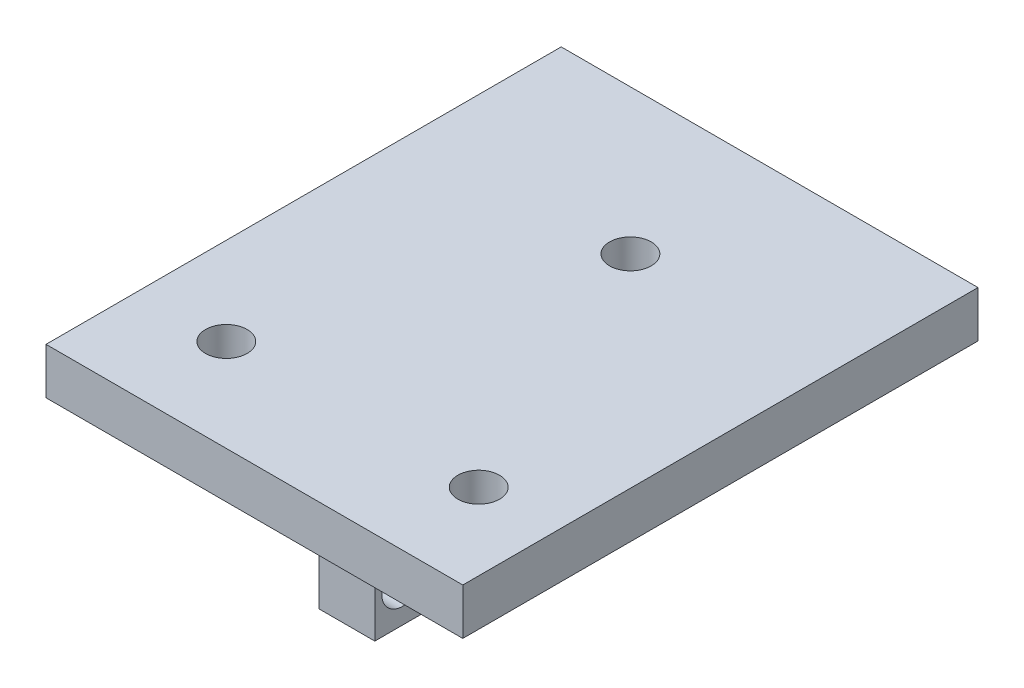
ISO-10303-21;
HEADER;
FILE_DESCRIPTION(('STEP AP214'),'2;1');
FILE_NAME('part.step','',(''),(''),'','','');
FILE_SCHEMA(('AUTOMOTIVE_DESIGN { 1 0 10303 214 1 1 1 1 }'));
ENDSEC;
DATA;
#1=APPLICATION_CONTEXT('core data for automotive mechanical design processes');
#2=APPLICATION_PROTOCOL_DEFINITION('international standard','automotive_design',2000,#1);
#3=PRODUCT_CONTEXT('',#1,'mechanical');
#4=PRODUCT('Part','Part','',(#3));
#5=PRODUCT_RELATED_PRODUCT_CATEGORY('part','',(#4));
#6=PRODUCT_DEFINITION_FORMATION('','',#4);
#7=PRODUCT_DEFINITION_CONTEXT('part definition',#1,'design');
#8=PRODUCT_DEFINITION('design','',#6,#7);
#9=PRODUCT_DEFINITION_SHAPE('','',#8);
#10=(LENGTH_UNIT() NAMED_UNIT(*) SI_UNIT(.MILLI.,.METRE.));
#11=(NAMED_UNIT(*) PLANE_ANGLE_UNIT() SI_UNIT($,.RADIAN.));
#12=(NAMED_UNIT(*) SI_UNIT($,.STERADIAN.) SOLID_ANGLE_UNIT());
#13=UNCERTAINTY_MEASURE_WITH_UNIT(LENGTH_MEASURE(1.E-05),#10,'distance_accuracy_value','');
#14=(GEOMETRIC_REPRESENTATION_CONTEXT(3) GLOBAL_UNCERTAINTY_ASSIGNED_CONTEXT((#13)) GLOBAL_UNIT_ASSIGNED_CONTEXT((#10,
#11,#12)) REPRESENTATION_CONTEXT('',''));
#15=CARTESIAN_POINT('',(0.,0.,0.));
#16=DIRECTION('',(0.,0.,1.));
#17=DIRECTION('',(1.,0.,0.));
#18=AXIS2_PLACEMENT_3D('',#15,#16,#17);
#19=CARTESIAN_POINT('',(0.,0.,0.));
#20=DIRECTION('',(0.,1.,0.));
#21=DIRECTION('',(0.,0.,1.));
#22=AXIS2_PLACEMENT_3D('',#19,#20,#21);
#23=PLANE('',#22);
#24=DIRECTION('',(0.,0.,-1.));
#25=VECTOR('',#24,1.);
#26=CARTESIAN_POINT('',(5.16102338934393,0.,-50.5));
#27=LINE('',#26,#25);
#28=CARTESIAN_POINT('',(5.16102338934393,0.,-44.5));
#29=VERTEX_POINT('',#28);
#30=CARTESIAN_POINT('',(5.16102338934393,0.,-50.5));
#31=VERTEX_POINT('',#30);
#32=EDGE_CURVE('E145',#29,#31,#27,.T.);
#33=ORIENTED_EDGE('',*,*,#32,.F.);
#34=DIRECTION('',(-1.,0.,0.));
#35=VECTOR('',#34,1.);
#36=CARTESIAN_POINT('',(5.16102338934393,0.,-44.5));
#37=LINE('',#36,#35);
#38=CARTESIAN_POINT('',(11.1610233893439,0.,-44.5));
#39=VERTEX_POINT('',#38);
#40=EDGE_CURVE('E158',#39,#29,#37,.T.);
#41=ORIENTED_EDGE('',*,*,#40,.F.);
#42=DIRECTION('',(0.,0.,1.));
#43=VECTOR('',#42,1.);
#44=CARTESIAN_POINT('',(11.1610233893439,0.,-50.5));
#45=LINE('',#44,#43);
#46=CARTESIAN_POINT('',(11.1610233893439,0.,-50.5));
#47=VERTEX_POINT('',#46);
#48=EDGE_CURVE('E167',#47,#39,#45,.T.);
#49=ORIENTED_EDGE('',*,*,#48,.F.);
#50=DIRECTION('',(1.,0.,0.));
#51=VECTOR('',#50,1.);
#52=CARTESIAN_POINT('',(5.16102338934393,0.,-50.5));
#53=LINE('',#52,#51);
#54=EDGE_CURVE('E148',#31,#47,#53,.T.);
#55=ORIENTED_EDGE('',*,*,#54,.F.);
#56=EDGE_LOOP('',(#33,#41,#49,#55));
#57=FACE_BOUND('',#56,.T.);
#58=CARTESIAN_POINT('',(-4.87219612087947,0.,-10.));
#59=DIRECTION('',(0.,-1.,0.));
#60=DIRECTION('',(0.,0.,-1.));
#61=AXIS2_PLACEMENT_3D('',#58,#59,#60);
#62=CIRCLE('',#61,2.24789999999999);
#63=CARTESIAN_POINT('',(-4.87219612087947,0.,-12.2479));
#64=VERTEX_POINT('',#63);
#65=EDGE_CURVE('E187',#64,#64,#62,.T.);
#66=ORIENTED_EDGE('',*,*,#65,.F.);
#67=EDGE_LOOP('',(#66));
#68=FACE_BOUND('',#67,.T.);
#69=DIRECTION('',(0.,0.,1.));
#70=VECTOR('',#69,1.);
#71=CARTESIAN_POINT('',(-14.3389766106561,0.,-55.6214886532175));
#72=LINE('',#71,#70);
#73=CARTESIAN_POINT('',(-14.3389766106561,0.,-55.6214886532175));
#74=VERTEX_POINT('',#73);
#75=CARTESIAN_POINT('',(-14.3389766106561,0.,0.));
#76=VERTEX_POINT('',#75);
#77=EDGE_CURVE('E199',#74,#76,#72,.T.);
#78=ORIENTED_EDGE('',*,*,#77,.F.);
#79=DIRECTION('',(-1.,0.,0.));
#80=VECTOR('',#79,1.);
#81=CARTESIAN_POINT('',(8.16102338934392,0.,-55.6214886532175));
#82=LINE('',#81,#80);
#83=CARTESIAN_POINT('',(30.6610233893439,0.,-55.6214886532175));
#84=VERTEX_POINT('',#83);
#85=EDGE_CURVE('E204',#84,#74,#82,.T.);
#86=ORIENTED_EDGE('',*,*,#85,.F.);
#87=DIRECTION('',(0.,0.,-1.));
#88=VECTOR('',#87,1.);
#89=CARTESIAN_POINT('',(30.6610233893439,0.,-55.6214886532175));
#90=LINE('',#89,#88);
#91=CARTESIAN_POINT('',(30.6610233893439,0.,0.));
#92=VERTEX_POINT('',#91);
#93=EDGE_CURVE('E215',#92,#84,#90,.T.);
#94=ORIENTED_EDGE('',*,*,#93,.F.);
#95=DIRECTION('',(1.,0.,0.));
#96=VECTOR('',#95,1.);
#97=CARTESIAN_POINT('',(-14.3389766106561,0.,0.));
#98=LINE('',#97,#96);
#99=EDGE_CURVE('E213',#76,#92,#98,.T.);
#100=ORIENTED_EDGE('',*,*,#99,.F.);
#101=EDGE_LOOP('',(#78,#86,#94,#100));
#102=FACE_BOUND('',#101,.T.);
#103=CARTESIAN_POINT('',(8.75280387912053,0.,-40.001031232276));
#104=DIRECTION('',(0.,-1.,0.));
#105=DIRECTION('',(0.,0.,-1.));
#106=AXIS2_PLACEMENT_3D('',#103,#104,#105);
#107=CIRCLE('',#106,2.24789999999999);
#108=CARTESIAN_POINT('',(8.75280387912053,0.,-42.248931232276));
#109=VERTEX_POINT('',#108);
#110=EDGE_CURVE('E193',#109,#109,#107,.T.);
#111=ORIENTED_EDGE('',*,*,#110,.F.);
#112=EDGE_LOOP('',(#111));
#113=FACE_BOUND('',#112,.T.);
#114=CARTESIAN_POINT('',(22.3778038791205,0.,-10.));
#115=DIRECTION('',(0.,-1.,0.));
#116=DIRECTION('',(0.,0.,-1.));
#117=AXIS2_PLACEMENT_3D('',#114,#115,#116);
#118=CIRCLE('',#117,2.24789999999999);
#119=CARTESIAN_POINT('',(22.3778038791205,0.,-12.2479));
#120=VERTEX_POINT('',#119);
#121=EDGE_CURVE('E183',#120,#120,#118,.T.);
#122=ORIENTED_EDGE('',*,*,#121,.F.);
#123=EDGE_LOOP('',(#122));
#124=FACE_BOUND('',#123,.T.);
#125=DIRECTION('',(0.,0.,-1.));
#126=VECTOR('',#125,1.);
#127=CARTESIAN_POINT('',(5.16102338934393,0.,-16.));
#128=LINE('',#127,#126);
#129=CARTESIAN_POINT('',(5.16102338934392,0.,-10.));
#130=VERTEX_POINT('',#129);
#131=CARTESIAN_POINT('',(5.16102338934393,0.,-16.));
#132=VERTEX_POINT('',#131);
#133=EDGE_CURVE('E144',#130,#132,#128,.T.);
#134=ORIENTED_EDGE('',*,*,#133,.F.);
#135=DIRECTION('',(-1.,0.,0.));
#136=VECTOR('',#135,1.);
#137=CARTESIAN_POINT('',(5.16102338934392,0.,-10.));
#138=LINE('',#137,#136);
#139=CARTESIAN_POINT('',(11.1610233893439,0.,-10.));
#140=VERTEX_POINT('',#139);
#141=EDGE_CURVE('E141',#140,#130,#138,.T.);
#142=ORIENTED_EDGE('',*,*,#141,.F.);
#143=DIRECTION('',(0.,0.,1.));
#144=VECTOR('',#143,1.);
#145=CARTESIAN_POINT('',(11.1610233893439,0.,-16.));
#146=LINE('',#145,#144);
#147=CARTESIAN_POINT('',(11.1610233893439,0.,-16.));
#148=VERTEX_POINT('',#147);
#149=EDGE_CURVE('E55',#148,#140,#146,.T.);
#150=ORIENTED_EDGE('',*,*,#149,.F.);
#151=DIRECTION('',(1.,0.,0.));
#152=VECTOR('',#151,1.);
#153=CARTESIAN_POINT('',(5.16102338934393,0.,-16.));
#154=LINE('',#153,#152);
#155=EDGE_CURVE('E50',#132,#148,#154,.T.);
#156=ORIENTED_EDGE('',*,*,#155,.F.);
#157=EDGE_LOOP('',(#134,#142,#150,#156));
#158=FACE_BOUND('',#157,.T.);
#159=ADVANCED_FACE('F33',(#57,#68,#102,#113,#124,#158),#23,.F.);
#160=CARTESIAN_POINT('',(-14.3389766106561,5.,-55.6214886532175));
#161=DIRECTION('',(1.,0.,0.));
#162=DIRECTION('',(0.,0.,-1.));
#163=AXIS2_PLACEMENT_3D('',#160,#161,#162);
#164=PLANE('',#163);
#165=ORIENTED_EDGE('',*,*,#77,.T.);
#166=DIRECTION('',(0.,-1.,0.));
#167=VECTOR('',#166,1.);
#168=CARTESIAN_POINT('',(-14.3389766106561,5.,0.));
#169=LINE('',#168,#167);
#170=CARTESIAN_POINT('',(-14.3389766106561,5.,0.));
#171=VERTEX_POINT('',#170);
#172=EDGE_CURVE('E11',#171,#76,#169,.T.);
#173=ORIENTED_EDGE('',*,*,#172,.F.);
#174=DIRECTION('',(0.,0.,1.));
#175=VECTOR('',#174,1.);
#176=CARTESIAN_POINT('',(-14.3389766106561,5.,-55.6214886532175));
#177=LINE('',#176,#175);
#178=CARTESIAN_POINT('',(-14.3389766106561,5.,-55.6214886532175));
#179=VERTEX_POINT('',#178);
#180=EDGE_CURVE('E200',#179,#171,#177,.T.);
#181=ORIENTED_EDGE('',*,*,#180,.F.);
#182=DIRECTION('',(0.,-1.,0.));
#183=VECTOR('',#182,1.);
#184=CARTESIAN_POINT('',(-14.3389766106561,5.,-55.6214886532175));
#185=LINE('',#184,#183);
#186=EDGE_CURVE('E210',#179,#74,#185,.T.);
#187=ORIENTED_EDGE('',*,*,#186,.T.);
#188=EDGE_LOOP('',(#165,#173,#181,#187));
#189=FACE_BOUND('',#188,.T.);
#190=ADVANCED_FACE('F35',(#189),#164,.F.);
#191=CARTESIAN_POINT('',(-14.3389766106561,5.,0.));
#192=DIRECTION('',(0.,0.,-1.));
#193=DIRECTION('',(-1.,0.,0.));
#194=AXIS2_PLACEMENT_3D('',#191,#192,#193);
#195=PLANE('',#194);
#196=ORIENTED_EDGE('',*,*,#99,.T.);
#197=DIRECTION('',(0.,-1.,0.));
#198=VECTOR('',#197,1.);
#199=CARTESIAN_POINT('',(30.6610233893439,5.,0.));
#200=LINE('',#199,#198);
#201=CARTESIAN_POINT('',(30.6610233893439,5.,0.));
#202=VERTEX_POINT('',#201);
#203=EDGE_CURVE('E42',#202,#92,#200,.T.);
#204=ORIENTED_EDGE('',*,*,#203,.F.);
#205=DIRECTION('',(1.,0.,0.));
#206=VECTOR('',#205,1.);
#207=CARTESIAN_POINT('',(-14.3389766106561,5.,0.));
#208=LINE('',#207,#206);
#209=EDGE_CURVE('E203',#171,#202,#208,.T.);
#210=ORIENTED_EDGE('',*,*,#209,.F.);
#211=ORIENTED_EDGE('',*,*,#172,.T.);
#212=EDGE_LOOP('',(#196,#204,#210,#211));
#213=FACE_BOUND('',#212,.T.);
#214=ADVANCED_FACE('F249',(#213),#195,.F.);
#215=CARTESIAN_POINT('',(30.6610233893439,5.,-55.6214886532175));
#216=DIRECTION('',(-1.,0.,0.));
#217=DIRECTION('',(0.,0.,1.));
#218=AXIS2_PLACEMENT_3D('',#215,#216,#217);
#219=PLANE('',#218);
#220=ORIENTED_EDGE('',*,*,#93,.T.);
#221=DIRECTION('',(0.,-1.,0.));
#222=VECTOR('',#221,1.);
#223=CARTESIAN_POINT('',(30.6610233893439,5.,-55.6214886532175));
#224=LINE('',#223,#222);
#225=CARTESIAN_POINT('',(30.6610233893439,5.,-55.6214886532175));
#226=VERTEX_POINT('',#225);
#227=EDGE_CURVE('E221',#226,#84,#224,.T.);
#228=ORIENTED_EDGE('',*,*,#227,.F.);
#229=DIRECTION('',(0.,0.,-1.));
#230=VECTOR('',#229,1.);
#231=CARTESIAN_POINT('',(30.6610233893439,5.,-55.6214886532175));
#232=LINE('',#231,#230);
#233=EDGE_CURVE('E206',#202,#226,#232,.T.);
#234=ORIENTED_EDGE('',*,*,#233,.F.);
#235=ORIENTED_EDGE('',*,*,#203,.T.);
#236=EDGE_LOOP('',(#220,#228,#234,#235));
#237=FACE_BOUND('',#236,.T.);
#238=ADVANCED_FACE('F254',(#237),#219,.F.);
#239=CARTESIAN_POINT('',(8.16102338934392,5.,-55.6214886532175));
#240=DIRECTION('',(0.,0.,1.));
#241=DIRECTION('',(1.,0.,0.));
#242=AXIS2_PLACEMENT_3D('',#239,#240,#241);
#243=PLANE('',#242);
#244=ORIENTED_EDGE('',*,*,#85,.T.);
#245=ORIENTED_EDGE('',*,*,#186,.F.);
#246=DIRECTION('',(-1.,0.,0.));
#247=VECTOR('',#246,1.);
#248=CARTESIAN_POINT('',(8.16102338934392,5.,-55.6214886532175));
#249=LINE('',#248,#247);
#250=EDGE_CURVE('E208',#226,#179,#249,.T.);
#251=ORIENTED_EDGE('',*,*,#250,.F.);
#252=ORIENTED_EDGE('',*,*,#227,.T.);
#253=EDGE_LOOP('',(#244,#245,#251,#252));
#254=FACE_BOUND('',#253,.T.);
#255=ADVANCED_FACE('F235',(#254),#243,.F.);
#256=CARTESIAN_POINT('',(0.,5.,0.));
#257=DIRECTION('',(0.,1.,0.));
#258=DIRECTION('',(0.,0.,1.));
#259=AXIS2_PLACEMENT_3D('',#256,#257,#258);
#260=PLANE('',#259);
#261=CARTESIAN_POINT('',(22.3778038791205,5.,-10.));
#262=DIRECTION('',(0.,1.,0.));
#263=DIRECTION('',(0.,0.,1.));
#264=AXIS2_PLACEMENT_3D('',#261,#262,#263);
#265=CIRCLE('',#264,2.24789999999999);
#266=CARTESIAN_POINT('',(22.3778038791205,5.,-7.75210000000001));
#267=VERTEX_POINT('',#266);
#268=EDGE_CURVE('E186',#267,#267,#265,.T.);
#269=ORIENTED_EDGE('',*,*,#268,.F.);
#270=EDGE_LOOP('',(#269));
#271=FACE_BOUND('',#270,.T.);
#272=CARTESIAN_POINT('',(-4.87219612087947,5.,-10.));
#273=DIRECTION('',(0.,1.,0.));
#274=DIRECTION('',(0.,0.,1.));
#275=AXIS2_PLACEMENT_3D('',#272,#273,#274);
#276=CIRCLE('',#275,2.24789999999999);
#277=CARTESIAN_POINT('',(-4.87219612087947,5.,-7.75210000000001));
#278=VERTEX_POINT('',#277);
#279=EDGE_CURVE('E190',#278,#278,#276,.T.);
#280=ORIENTED_EDGE('',*,*,#279,.F.);
#281=EDGE_LOOP('',(#280));
#282=FACE_BOUND('',#281,.T.);
#283=CARTESIAN_POINT('',(8.75280387912053,5.,-40.001031232276));
#284=DIRECTION('',(0.,1.,0.));
#285=DIRECTION('',(0.,0.,1.));
#286=AXIS2_PLACEMENT_3D('',#283,#284,#285);
#287=CIRCLE('',#286,2.24789999999999);
#288=CARTESIAN_POINT('',(8.75280387912053,5.,-37.753131232276));
#289=VERTEX_POINT('',#288);
#290=EDGE_CURVE('E196',#289,#289,#287,.T.);
#291=ORIENTED_EDGE('',*,*,#290,.F.);
#292=EDGE_LOOP('',(#291));
#293=FACE_BOUND('',#292,.T.);
#294=ORIENTED_EDGE('',*,*,#180,.T.);
#295=ORIENTED_EDGE('',*,*,#209,.T.);
#296=ORIENTED_EDGE('',*,*,#233,.T.);
#297=ORIENTED_EDGE('',*,*,#250,.T.);
#298=EDGE_LOOP('',(#294,#295,#296,#297));
#299=FACE_BOUND('',#298,.T.);
#300=ADVANCED_FACE('F231',(#271,#282,#293,#299),#260,.T.);
#301=CARTESIAN_POINT('',(8.75280387912053,0.,-40.001031232276));
#302=DIRECTION('',(0.,-1.,0.));
#303=DIRECTION('',(0.,0.,-1.));
#304=AXIS2_PLACEMENT_3D('',#301,#302,#303);
#305=CYLINDRICAL_SURFACE('',#304,2.24789999999999);
#306=ORIENTED_EDGE('',*,*,#290,.T.);
#307=EDGE_LOOP('',(#306));
#308=FACE_BOUND('',#307,.T.);
#309=ORIENTED_EDGE('',*,*,#110,.T.);
#310=EDGE_LOOP('',(#309));
#311=FACE_BOUND('',#310,.T.);
#312=ADVANCED_FACE('F234',(#308,#311),#305,.F.);
#313=CARTESIAN_POINT('',(-4.87219612087947,0.,-10.));
#314=DIRECTION('',(0.,-1.,0.));
#315=DIRECTION('',(0.,0.,-1.));
#316=AXIS2_PLACEMENT_3D('',#313,#314,#315);
#317=CYLINDRICAL_SURFACE('',#316,2.24789999999999);
#318=ORIENTED_EDGE('',*,*,#279,.T.);
#319=EDGE_LOOP('',(#318));
#320=FACE_BOUND('',#319,.T.);
#321=ORIENTED_EDGE('',*,*,#65,.T.);
#322=EDGE_LOOP('',(#321));
#323=FACE_BOUND('',#322,.T.);
#324=ADVANCED_FACE('F337',(#320,#323),#317,.F.);
#325=CARTESIAN_POINT('',(22.3778038791205,0.,-10.));
#326=DIRECTION('',(0.,-1.,0.));
#327=DIRECTION('',(0.,0.,-1.));
#328=AXIS2_PLACEMENT_3D('',#325,#326,#327);
#329=CYLINDRICAL_SURFACE('',#328,2.24789999999999);
#330=ORIENTED_EDGE('',*,*,#268,.T.);
#331=EDGE_LOOP('',(#330));
#332=FACE_BOUND('',#331,.T.);
#333=ORIENTED_EDGE('',*,*,#121,.T.);
#334=EDGE_LOOP('',(#333));
#335=FACE_BOUND('',#334,.T.);
#336=ADVANCED_FACE('F228',(#332,#335),#329,.F.);
#337=CARTESIAN_POINT('',(5.16102338934393,-15.,-50.5));
#338=DIRECTION('',(1.,0.,0.));
#339=DIRECTION('',(0.,0.,-1.));
#340=AXIS2_PLACEMENT_3D('',#337,#338,#339);
#341=PLANE('',#340);
#342=CARTESIAN_POINT('',(5.16102338934393,-11.,-47.5));
#343=DIRECTION('',(-1.,0.,0.));
#344=DIRECTION('',(0.,0.,1.));
#345=AXIS2_PLACEMENT_3D('',#342,#343,#344);
#346=CIRCLE('',#345,2.24789999999999);
#347=CARTESIAN_POINT('',(5.16102338934393,-11.,-45.2521));
#348=VERTEX_POINT('',#347);
#349=EDGE_CURVE('E284',#348,#348,#346,.T.);
#350=ORIENTED_EDGE('',*,*,#349,.F.);
#351=EDGE_LOOP('',(#350));
#352=FACE_BOUND('',#351,.T.);
#353=ORIENTED_EDGE('',*,*,#32,.T.);
#354=DIRECTION('',(0.,1.,0.));
#355=VECTOR('',#354,1.);
#356=CARTESIAN_POINT('',(5.16102338934393,-15.,-50.5));
#357=LINE('',#356,#355);
#358=CARTESIAN_POINT('',(5.16102338934393,-15.,-50.5));
#359=VERTEX_POINT('',#358);
#360=EDGE_CURVE('E180',#359,#31,#357,.T.);
#361=ORIENTED_EDGE('',*,*,#360,.F.);
#362=DIRECTION('',(0.,0.,-1.));
#363=VECTOR('',#362,1.);
#364=CARTESIAN_POINT('',(5.16102338934393,-15.,-50.5));
#365=LINE('',#364,#363);
#366=CARTESIAN_POINT('',(5.16102338934393,-15.,-44.5));
#367=VERTEX_POINT('',#366);
#368=EDGE_CURVE('E154',#367,#359,#365,.T.);
#369=ORIENTED_EDGE('',*,*,#368,.F.);
#370=DIRECTION('',(0.,1.,0.));
#371=VECTOR('',#370,1.);
#372=CARTESIAN_POINT('',(5.16102338934393,-15.,-44.5));
#373=LINE('',#372,#371);
#374=EDGE_CURVE('E163',#367,#29,#373,.T.);
#375=ORIENTED_EDGE('',*,*,#374,.T.);
#376=EDGE_LOOP('',(#353,#361,#369,#375));
#377=FACE_BOUND('',#376,.T.);
#378=ADVANCED_FACE('F330',(#352,#377),#341,.F.);
#379=CARTESIAN_POINT('',(5.16102338934393,-15.,-50.5));
#380=DIRECTION('',(0.,0.,1.));
#381=DIRECTION('',(1.,0.,0.));
#382=AXIS2_PLACEMENT_3D('',#379,#380,#381);
#383=PLANE('',#382);
#384=ORIENTED_EDGE('',*,*,#54,.T.);
#385=DIRECTION('',(0.,1.,0.));
#386=VECTOR('',#385,1.);
#387=CARTESIAN_POINT('',(11.1610233893439,-15.,-50.5));
#388=LINE('',#387,#386);
#389=CARTESIAN_POINT('',(11.1610233893439,-15.,-50.5));
#390=VERTEX_POINT('',#389);
#391=EDGE_CURVE('E177',#390,#47,#388,.T.);
#392=ORIENTED_EDGE('',*,*,#391,.F.);
#393=DIRECTION('',(1.,0.,0.));
#394=VECTOR('',#393,1.);
#395=CARTESIAN_POINT('',(5.16102338934393,-15.,-50.5));
#396=LINE('',#395,#394);
#397=EDGE_CURVE('E157',#359,#390,#396,.T.);
#398=ORIENTED_EDGE('',*,*,#397,.F.);
#399=ORIENTED_EDGE('',*,*,#360,.T.);
#400=EDGE_LOOP('',(#384,#392,#398,#399));
#401=FACE_BOUND('',#400,.T.);
#402=ADVANCED_FACE('F327',(#401),#383,.F.);
#403=CARTESIAN_POINT('',(11.1610233893439,-15.,-50.5));
#404=DIRECTION('',(-1.,0.,0.));
#405=DIRECTION('',(0.,0.,1.));
#406=AXIS2_PLACEMENT_3D('',#403,#404,#405);
#407=PLANE('',#406);
#408=CARTESIAN_POINT('',(11.1610233893439,-11.,-47.5));
#409=DIRECTION('',(-1.,0.,0.));
#410=DIRECTION('',(0.,0.,1.));
#411=AXIS2_PLACEMENT_3D('',#408,#409,#410);
#412=CIRCLE('',#411,2.24789999999999);
#413=CARTESIAN_POINT('',(11.1610233893439,-11.,-45.2521));
#414=VERTEX_POINT('',#413);
#415=EDGE_CURVE('E37',#414,#414,#412,.T.);
#416=ORIENTED_EDGE('',*,*,#415,.T.);
#417=EDGE_LOOP('',(#416));
#418=FACE_BOUND('',#417,.T.);
#419=ORIENTED_EDGE('',*,*,#48,.T.);
#420=DIRECTION('',(0.,1.,0.));
#421=VECTOR('',#420,1.);
#422=CARTESIAN_POINT('',(11.1610233893439,-15.,-44.5));
#423=LINE('',#422,#421);
#424=CARTESIAN_POINT('',(11.1610233893439,-15.,-44.5));
#425=VERTEX_POINT('',#424);
#426=EDGE_CURVE('E174',#425,#39,#423,.T.);
#427=ORIENTED_EDGE('',*,*,#426,.F.);
#428=DIRECTION('',(0.,0.,1.));
#429=VECTOR('',#428,1.);
#430=CARTESIAN_POINT('',(11.1610233893439,-15.,-50.5));
#431=LINE('',#430,#429);
#432=EDGE_CURVE('E160',#390,#425,#431,.T.);
#433=ORIENTED_EDGE('',*,*,#432,.F.);
#434=ORIENTED_EDGE('',*,*,#391,.T.);
#435=EDGE_LOOP('',(#419,#427,#433,#434));
#436=FACE_BOUND('',#435,.T.);
#437=ADVANCED_FACE('F291',(#418,#436),#407,.F.);
#438=CARTESIAN_POINT('',(5.16102338934393,-15.,-44.5));
#439=DIRECTION('',(0.,0.,-1.));
#440=DIRECTION('',(-1.,0.,0.));
#441=AXIS2_PLACEMENT_3D('',#438,#439,#440);
#442=PLANE('',#441);
#443=ORIENTED_EDGE('',*,*,#40,.T.);
#444=ORIENTED_EDGE('',*,*,#374,.F.);
#445=DIRECTION('',(-1.,0.,0.));
#446=VECTOR('',#445,1.);
#447=CARTESIAN_POINT('',(5.16102338934393,-15.,-44.5));
#448=LINE('',#447,#446);
#449=EDGE_CURVE('E162',#425,#367,#448,.T.);
#450=ORIENTED_EDGE('',*,*,#449,.F.);
#451=ORIENTED_EDGE('',*,*,#426,.T.);
#452=EDGE_LOOP('',(#443,#444,#450,#451));
#453=FACE_BOUND('',#452,.T.);
#454=ADVANCED_FACE('F320',(#453),#442,.F.);
#455=CARTESIAN_POINT('',(0.,-15.,0.));
#456=DIRECTION('',(0.,1.,0.));
#457=DIRECTION('',(0.,0.,1.));
#458=AXIS2_PLACEMENT_3D('',#455,#456,#457);
#459=PLANE('',#458);
#460=ORIENTED_EDGE('',*,*,#368,.T.);
#461=ORIENTED_EDGE('',*,*,#397,.T.);
#462=ORIENTED_EDGE('',*,*,#432,.T.);
#463=ORIENTED_EDGE('',*,*,#449,.T.);
#464=EDGE_LOOP('',(#460,#461,#462,#463));
#465=FACE_BOUND('',#464,.T.);
#466=ADVANCED_FACE('F316',(#465),#459,.F.);
#467=CARTESIAN_POINT('',(5.16102338934393,-15.,-16.));
#468=DIRECTION('',(1.,0.,0.));
#469=DIRECTION('',(0.,0.,-1.));
#470=AXIS2_PLACEMENT_3D('',#467,#468,#469);
#471=PLANE('',#470);
#472=CARTESIAN_POINT('',(5.16102338934392,-11.,-13.));
#473=DIRECTION('',(-1.,0.,0.));
#474=DIRECTION('',(0.,0.,1.));
#475=AXIS2_PLACEMENT_3D('',#472,#473,#474);
#476=CIRCLE('',#475,2.24789999999999);
#477=CARTESIAN_POINT('',(5.16102338934392,-11.,-10.7521));
#478=VERTEX_POINT('',#477);
#479=EDGE_CURVE('E281',#478,#478,#476,.T.);
#480=ORIENTED_EDGE('',*,*,#479,.F.);
#481=EDGE_LOOP('',(#480));
#482=FACE_BOUND('',#481,.T.);
#483=ORIENTED_EDGE('',*,*,#133,.T.);
#484=DIRECTION('',(0.,1.,0.));
#485=VECTOR('',#484,1.);
#486=CARTESIAN_POINT('',(5.16102338934393,-15.,-16.));
#487=LINE('',#486,#485);
#488=CARTESIAN_POINT('',(5.16102338934393,-15.,-16.));
#489=VERTEX_POINT('',#488);
#490=EDGE_CURVE('E125',#489,#132,#487,.T.);
#491=ORIENTED_EDGE('',*,*,#490,.F.);
#492=DIRECTION('',(0.,0.,-1.));
#493=VECTOR('',#492,1.);
#494=CARTESIAN_POINT('',(5.16102338934393,-15.,-16.));
#495=LINE('',#494,#493);
#496=CARTESIAN_POINT('',(5.16102338934392,-15.,-10.));
#497=VERTEX_POINT('',#496);
#498=EDGE_CURVE('E132',#497,#489,#495,.T.);
#499=ORIENTED_EDGE('',*,*,#498,.F.);
#500=DIRECTION('',(0.,1.,0.));
#501=VECTOR('',#500,1.);
#502=CARTESIAN_POINT('',(5.16102338934392,-15.,-10.));
#503=LINE('',#502,#501);
#504=EDGE_CURVE('E270',#497,#130,#503,.T.);
#505=ORIENTED_EDGE('',*,*,#504,.T.);
#506=EDGE_LOOP('',(#483,#491,#499,#505));
#507=FACE_BOUND('',#506,.T.);
#508=ADVANCED_FACE('F143',(#482,#507),#471,.F.);
#509=CARTESIAN_POINT('',(5.16102338934393,-15.,-16.));
#510=DIRECTION('',(0.,0.,1.));
#511=DIRECTION('',(1.,0.,0.));
#512=AXIS2_PLACEMENT_3D('',#509,#510,#511);
#513=PLANE('',#512);
#514=ORIENTED_EDGE('',*,*,#155,.T.);
#515=DIRECTION('',(0.,1.,0.));
#516=VECTOR('',#515,1.);
#517=CARTESIAN_POINT('',(11.1610233893439,-15.,-16.));
#518=LINE('',#517,#516);
#519=CARTESIAN_POINT('',(11.1610233893439,-15.,-16.));
#520=VERTEX_POINT('',#519);
#521=EDGE_CURVE('E128',#520,#148,#518,.T.);
#522=ORIENTED_EDGE('',*,*,#521,.F.);
#523=DIRECTION('',(1.,0.,0.));
#524=VECTOR('',#523,1.);
#525=CARTESIAN_POINT('',(5.16102338934393,-15.,-16.));
#526=LINE('',#525,#524);
#527=EDGE_CURVE('E121',#489,#520,#526,.T.);
#528=ORIENTED_EDGE('',*,*,#527,.F.);
#529=ORIENTED_EDGE('',*,*,#490,.T.);
#530=EDGE_LOOP('',(#514,#522,#528,#529));
#531=FACE_BOUND('',#530,.T.);
#532=ADVANCED_FACE('F123',(#531),#513,.F.);
#533=CARTESIAN_POINT('',(11.1610233893439,-15.,-16.));
#534=DIRECTION('',(-1.,0.,0.));
#535=DIRECTION('',(0.,0.,1.));
#536=AXIS2_PLACEMENT_3D('',#533,#534,#535);
#537=PLANE('',#536);
#538=CARTESIAN_POINT('',(11.1610233893439,-11.,-13.));
#539=DIRECTION('',(-1.,0.,0.));
#540=DIRECTION('',(0.,0.,1.));
#541=AXIS2_PLACEMENT_3D('',#538,#539,#540);
#542=CIRCLE('',#541,2.24789999999999);
#543=CARTESIAN_POINT('',(11.1610233893439,-11.,-10.7521));
#544=VERTEX_POINT('',#543);
#545=EDGE_CURVE('E265',#544,#544,#542,.T.);
#546=ORIENTED_EDGE('',*,*,#545,.T.);
#547=EDGE_LOOP('',(#546));
#548=FACE_BOUND('',#547,.T.);
#549=ORIENTED_EDGE('',*,*,#149,.T.);
#550=DIRECTION('',(0.,1.,0.));
#551=VECTOR('',#550,1.);
#552=CARTESIAN_POINT('',(11.1610233893439,-15.,-10.));
#553=LINE('',#552,#551);
#554=CARTESIAN_POINT('',(11.1610233893439,-15.,-10.));
#555=VERTEX_POINT('',#554);
#556=EDGE_CURVE('E150',#555,#140,#553,.T.);
#557=ORIENTED_EDGE('',*,*,#556,.F.);
#558=DIRECTION('',(0.,0.,1.));
#559=VECTOR('',#558,1.);
#560=CARTESIAN_POINT('',(11.1610233893439,-15.,-16.));
#561=LINE('',#560,#559);
#562=EDGE_CURVE('E131',#520,#555,#561,.T.);
#563=ORIENTED_EDGE('',*,*,#562,.F.);
#564=ORIENTED_EDGE('',*,*,#521,.T.);
#565=EDGE_LOOP('',(#549,#557,#563,#564));
#566=FACE_BOUND('',#565,.T.);
#567=ADVANCED_FACE('F308',(#548,#566),#537,.F.);
#568=CARTESIAN_POINT('',(5.16102338934392,-15.,-10.));
#569=DIRECTION('',(0.,0.,-1.));
#570=DIRECTION('',(-1.,0.,0.));
#571=AXIS2_PLACEMENT_3D('',#568,#569,#570);
#572=PLANE('',#571);
#573=ORIENTED_EDGE('',*,*,#141,.T.);
#574=ORIENTED_EDGE('',*,*,#504,.F.);
#575=DIRECTION('',(-1.,0.,0.));
#576=VECTOR('',#575,1.);
#577=CARTESIAN_POINT('',(5.16102338934392,-15.,-10.));
#578=LINE('',#577,#576);
#579=EDGE_CURVE('E137',#555,#497,#578,.T.);
#580=ORIENTED_EDGE('',*,*,#579,.F.);
#581=ORIENTED_EDGE('',*,*,#556,.T.);
#582=EDGE_LOOP('',(#573,#574,#580,#581));
#583=FACE_BOUND('',#582,.T.);
#584=ADVANCED_FACE('F269',(#583),#572,.F.);
#585=CARTESIAN_POINT('',(0.,-15.,0.));
#586=DIRECTION('',(0.,1.,0.));
#587=DIRECTION('',(0.,0.,1.));
#588=AXIS2_PLACEMENT_3D('',#585,#586,#587);
#589=PLANE('',#588);
#590=ORIENTED_EDGE('',*,*,#498,.T.);
#591=ORIENTED_EDGE('',*,*,#527,.T.);
#592=ORIENTED_EDGE('',*,*,#562,.T.);
#593=ORIENTED_EDGE('',*,*,#579,.T.);
#594=EDGE_LOOP('',(#590,#591,#592,#593));
#595=FACE_BOUND('',#594,.T.);
#596=ADVANCED_FACE('F135',(#595),#589,.F.);
#597=CARTESIAN_POINT('',(5.16102338934392,-11.,-13.));
#598=DIRECTION('',(-1.,0.,0.));
#599=DIRECTION('',(0.,0.,1.));
#600=AXIS2_PLACEMENT_3D('',#597,#598,#599);
#601=CYLINDRICAL_SURFACE('',#600,2.24789999999999);
#602=ORIENTED_EDGE('',*,*,#479,.T.);
#603=EDGE_LOOP('',(#602));
#604=FACE_BOUND('',#603,.T.);
#605=ORIENTED_EDGE('',*,*,#545,.F.);
#606=EDGE_LOOP('',(#605));
#607=FACE_BOUND('',#606,.T.);
#608=ADVANCED_FACE('F296',(#604,#607),#601,.F.);
#609=CARTESIAN_POINT('',(5.16102338934393,-11.,-47.5));
#610=DIRECTION('',(-1.,0.,0.));
#611=DIRECTION('',(0.,0.,1.));
#612=AXIS2_PLACEMENT_3D('',#609,#610,#611);
#613=CYLINDRICAL_SURFACE('',#612,2.24789999999999);
#614=ORIENTED_EDGE('',*,*,#349,.T.);
#615=EDGE_LOOP('',(#614));
#616=FACE_BOUND('',#615,.T.);
#617=ORIENTED_EDGE('',*,*,#415,.F.);
#618=EDGE_LOOP('',(#617));
#619=FACE_BOUND('',#618,.T.);
#620=ADVANCED_FACE('F294',(#616,#619),#613,.F.);
#621=CLOSED_SHELL('',(#159,#190,#214,#238,#255,#300,#312,#324,#336,#378,#402,#437,#454,#466,
#508,#532,#567,#584,#596,#608,#620));
#622=MANIFOLD_SOLID_BREP('B2',#621);
#623=ADVANCED_BREP_SHAPE_REPRESENTATION('',(#18,#622),#14);
#624=SHAPE_DEFINITION_REPRESENTATION(#9,#623);
ENDSEC;
END-ISO-10303-21;
